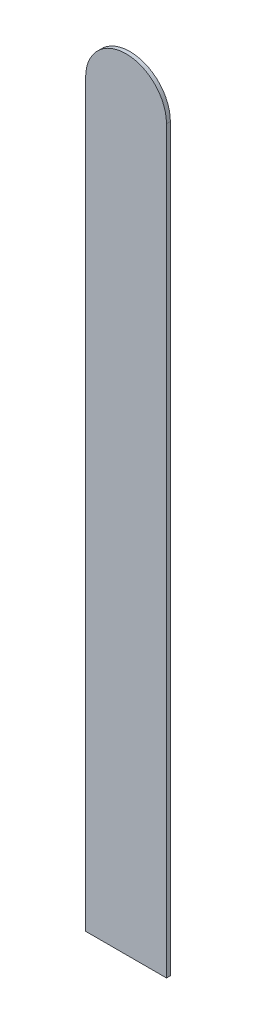
ISO-10303-21;
HEADER;
FILE_DESCRIPTION(('STEP AP214'),'2;1');
FILE_NAME('part.step','',(''),(''),'','','');
FILE_SCHEMA(('AUTOMOTIVE_DESIGN { 1 0 10303 214 1 1 1 1 }'));
ENDSEC;
DATA;
#1=APPLICATION_CONTEXT('core data for automotive mechanical design processes');
#2=APPLICATION_PROTOCOL_DEFINITION('international standard','automotive_design',2000,#1);
#3=PRODUCT_CONTEXT('',#1,'mechanical');
#4=PRODUCT('Part','Part','',(#3));
#5=PRODUCT_RELATED_PRODUCT_CATEGORY('part','',(#4));
#6=PRODUCT_DEFINITION_FORMATION('','',#4);
#7=PRODUCT_DEFINITION_CONTEXT('part definition',#1,'design');
#8=PRODUCT_DEFINITION('design','',#6,#7);
#9=PRODUCT_DEFINITION_SHAPE('','',#8);
#10=(LENGTH_UNIT() NAMED_UNIT(*) SI_UNIT(.MILLI.,.METRE.));
#11=(NAMED_UNIT(*) PLANE_ANGLE_UNIT() SI_UNIT($,.RADIAN.));
#12=(NAMED_UNIT(*) SI_UNIT($,.STERADIAN.) SOLID_ANGLE_UNIT());
#13=UNCERTAINTY_MEASURE_WITH_UNIT(LENGTH_MEASURE(1.E-05),#10,'distance_accuracy_value','');
#14=(GEOMETRIC_REPRESENTATION_CONTEXT(3) GLOBAL_UNCERTAINTY_ASSIGNED_CONTEXT((#13)) GLOBAL_UNIT_ASSIGNED_CONTEXT((#10,
#11,#12)) REPRESENTATION_CONTEXT('',''));
#15=CARTESIAN_POINT('',(0.,0.,0.));
#16=DIRECTION('',(0.,0.,1.));
#17=DIRECTION('',(1.,0.,0.));
#18=AXIS2_PLACEMENT_3D('',#15,#16,#17);
#19=CARTESIAN_POINT('',(-3.17499999999999,70.6374,0.3048));
#20=DIRECTION('',(0.,0.,-1.));
#21=DIRECTION('',(-1.,0.,0.));
#22=AXIS2_PLACEMENT_3D('',#19,#20,#21);
#23=CYLINDRICAL_SURFACE('',#22,3.17500000000001);
#24=CARTESIAN_POINT('',(-3.17499999999999,70.6374,0.));
#25=DIRECTION('',(0.,0.,1.));
#26=DIRECTION('',(1.,0.,0.));
#27=AXIS2_PLACEMENT_3D('',#24,#25,#26);
#28=CIRCLE('',#27,3.17500000000001);
#29=CARTESIAN_POINT('',(0.,70.6374,0.));
#30=VERTEX_POINT('',#29);
#31=CARTESIAN_POINT('',(-6.35,70.6374,0.));
#32=VERTEX_POINT('',#31);
#33=EDGE_CURVE('E96',#30,#32,#28,.T.);
#34=ORIENTED_EDGE('',*,*,#33,.T.);
#35=DIRECTION('',(0.,0.,-1.));
#36=VECTOR('',#35,1.);
#37=CARTESIAN_POINT('',(-6.35,70.6374,0.3048));
#38=LINE('',#37,#36);
#39=CARTESIAN_POINT('',(-6.35,70.6374,0.3048));
#40=VERTEX_POINT('',#39);
#41=EDGE_CURVE('E11',#40,#32,#38,.T.);
#42=ORIENTED_EDGE('',*,*,#41,.F.);
#43=CARTESIAN_POINT('',(-3.17499999999999,70.6374,0.3048));
#44=DIRECTION('',(0.,0.,1.));
#45=DIRECTION('',(1.,0.,0.));
#46=AXIS2_PLACEMENT_3D('',#43,#44,#45);
#47=CIRCLE('',#46,3.17500000000001);
#48=CARTESIAN_POINT('',(0.,70.6374,0.3048));
#49=VERTEX_POINT('',#48);
#50=EDGE_CURVE('E84',#49,#40,#47,.T.);
#51=ORIENTED_EDGE('',*,*,#50,.F.);
#52=DIRECTION('',(0.,0.,-1.));
#53=VECTOR('',#52,1.);
#54=CARTESIAN_POINT('',(0.,70.6374,0.3048));
#55=LINE('',#54,#53);
#56=EDGE_CURVE('E92',#49,#30,#55,.T.);
#57=ORIENTED_EDGE('',*,*,#56,.T.);
#58=EDGE_LOOP('',(#34,#42,#51,#57));
#59=FACE_BOUND('',#58,.T.);
#60=ADVANCED_FACE('F33',(#59),#23,.T.);
#61=CARTESIAN_POINT('',(-6.35,70.6374,0.3048));
#62=DIRECTION('',(1.,0.,0.));
#63=DIRECTION('',(0.,0.,-1.));
#64=AXIS2_PLACEMENT_3D('',#61,#62,#63);
#65=PLANE('',#64);
#66=DIRECTION('',(0.,-1.,0.));
#67=VECTOR('',#66,1.);
#68=CARTESIAN_POINT('',(-6.35,70.6374,0.));
#69=LINE('',#68,#67);
#70=CARTESIAN_POINT('',(-6.35,12.5222,0.));
#71=VERTEX_POINT('',#70);
#72=EDGE_CURVE('E88',#32,#71,#69,.T.);
#73=ORIENTED_EDGE('',*,*,#72,.T.);
#74=DIRECTION('',(0.,0.,-1.));
#75=VECTOR('',#74,1.);
#76=CARTESIAN_POINT('',(-6.35,12.5222,0.3048));
#77=LINE('',#76,#75);
#78=CARTESIAN_POINT('',(-6.35,12.5222,0.3048));
#79=VERTEX_POINT('',#78);
#80=EDGE_CURVE('E41',#79,#71,#77,.T.);
#81=ORIENTED_EDGE('',*,*,#80,.F.);
#82=DIRECTION('',(0.,-1.,0.));
#83=VECTOR('',#82,1.);
#84=CARTESIAN_POINT('',(-6.35,70.6374,0.3048));
#85=LINE('',#84,#83);
#86=EDGE_CURVE('E79',#40,#79,#85,.T.);
#87=ORIENTED_EDGE('',*,*,#86,.F.);
#88=ORIENTED_EDGE('',*,*,#41,.T.);
#89=EDGE_LOOP('',(#73,#81,#87,#88));
#90=FACE_BOUND('',#89,.T.);
#91=ADVANCED_FACE('F87',(#90),#65,.F.);
#92=CARTESIAN_POINT('',(0.,12.5222,0.3048));
#93=DIRECTION('',(0.,1.,0.));
#94=DIRECTION('',(-1.,0.,0.));
#95=AXIS2_PLACEMENT_3D('',#92,#93,#94);
#96=PLANE('',#95);
#97=DIRECTION('',(1.,0.,0.));
#98=VECTOR('',#97,1.);
#99=CARTESIAN_POINT('',(0.,12.5222,0.));
#100=LINE('',#99,#98);
#101=CARTESIAN_POINT('',(0.,12.5222,0.));
#102=VERTEX_POINT('',#101);
#103=EDGE_CURVE('E66',#71,#102,#100,.T.);
#104=ORIENTED_EDGE('',*,*,#103,.T.);
#105=DIRECTION('',(0.,0.,-1.));
#106=VECTOR('',#105,1.);
#107=CARTESIAN_POINT('',(0.,12.5222,0.3048));
#108=LINE('',#107,#106);
#109=CARTESIAN_POINT('',(0.,12.5222,0.3048));
#110=VERTEX_POINT('',#109);
#111=EDGE_CURVE('E89',#110,#102,#108,.T.);
#112=ORIENTED_EDGE('',*,*,#111,.F.);
#113=DIRECTION('',(1.,0.,0.));
#114=VECTOR('',#113,1.);
#115=CARTESIAN_POINT('',(0.,12.5222,0.3048));
#116=LINE('',#115,#114);
#117=EDGE_CURVE('E82',#79,#110,#116,.T.);
#118=ORIENTED_EDGE('',*,*,#117,.F.);
#119=ORIENTED_EDGE('',*,*,#80,.T.);
#120=EDGE_LOOP('',(#104,#112,#118,#119));
#121=FACE_BOUND('',#120,.T.);
#122=ADVANCED_FACE('F90',(#121),#96,.F.);
#123=CARTESIAN_POINT('',(0.,70.6374,0.3048));
#124=DIRECTION('',(-1.,0.,0.));
#125=DIRECTION('',(0.,-1.,0.));
#126=AXIS2_PLACEMENT_3D('',#123,#124,#125);
#127=PLANE('',#126);
#128=DIRECTION('',(0.,1.,0.));
#129=VECTOR('',#128,1.);
#130=CARTESIAN_POINT('',(0.,70.6374,0.));
#131=LINE('',#130,#129);
#132=EDGE_CURVE('E72',#102,#30,#131,.T.);
#133=ORIENTED_EDGE('',*,*,#132,.T.);
#134=ORIENTED_EDGE('',*,*,#56,.F.);
#135=DIRECTION('',(0.,1.,0.));
#136=VECTOR('',#135,1.);
#137=CARTESIAN_POINT('',(0.,70.6374,0.3048));
#138=LINE('',#137,#136);
#139=EDGE_CURVE('E49',#110,#49,#138,.T.);
#140=ORIENTED_EDGE('',*,*,#139,.F.);
#141=ORIENTED_EDGE('',*,*,#111,.T.);
#142=EDGE_LOOP('',(#133,#134,#140,#141));
#143=FACE_BOUND('',#142,.T.);
#144=ADVANCED_FACE('F103',(#143),#127,.F.);
#145=CARTESIAN_POINT('',(-3.17499999999999,70.6374,0.3048));
#146=DIRECTION('',(0.,0.,1.));
#147=DIRECTION('',(1.,0.,0.));
#148=AXIS2_PLACEMENT_3D('',#145,#146,#147);
#149=PLANE('',#148);
#150=ORIENTED_EDGE('',*,*,#50,.T.);
#151=ORIENTED_EDGE('',*,*,#86,.T.);
#152=ORIENTED_EDGE('',*,*,#117,.T.);
#153=ORIENTED_EDGE('',*,*,#139,.T.);
#154=EDGE_LOOP('',(#150,#151,#152,#153));
#155=FACE_BOUND('',#154,.T.);
#156=ADVANCED_FACE('F80',(#155),#149,.T.);
#157=CARTESIAN_POINT('',(-3.17499999999999,70.6374,0.));
#158=DIRECTION('',(0.,0.,1.));
#159=DIRECTION('',(1.,0.,0.));
#160=AXIS2_PLACEMENT_3D('',#157,#158,#159);
#161=PLANE('',#160);
#162=ORIENTED_EDGE('',*,*,#33,.F.);
#163=ORIENTED_EDGE('',*,*,#132,.F.);
#164=ORIENTED_EDGE('',*,*,#103,.F.);
#165=ORIENTED_EDGE('',*,*,#72,.F.);
#166=EDGE_LOOP('',(#162,#163,#164,#165));
#167=FACE_BOUND('',#166,.T.);
#168=ADVANCED_FACE('F106',(#167),#161,.F.);
#169=CLOSED_SHELL('',(#60,#91,#122,#144,#156,#168));
#170=MANIFOLD_SOLID_BREP('B2',#169);
#171=ADVANCED_BREP_SHAPE_REPRESENTATION('',(#18,#170),#14);
#172=SHAPE_DEFINITION_REPRESENTATION(#9,#171);
ENDSEC;
END-ISO-10303-21;
